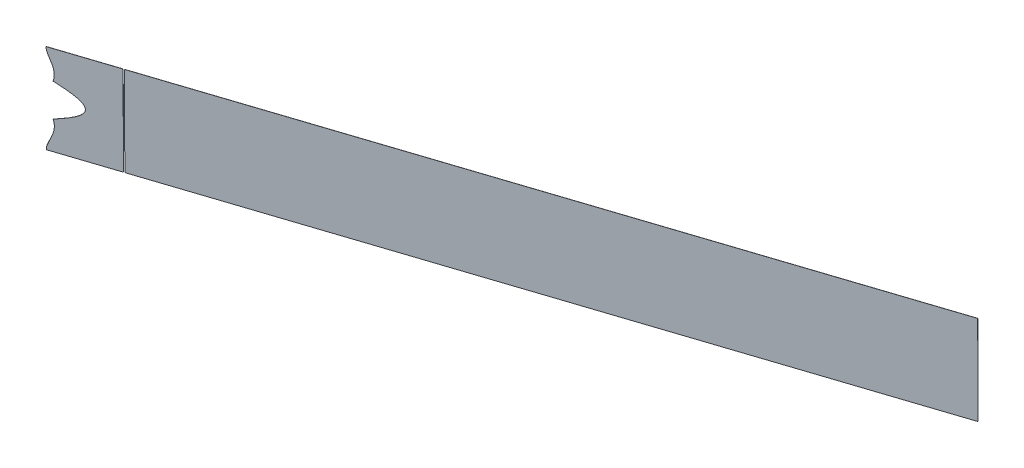
ISO-10303-21;
HEADER;
FILE_DESCRIPTION(('STEP AP214'),'2;1');
FILE_NAME('part.step','',(''),(''),'','','');
FILE_SCHEMA(('AUTOMOTIVE_DESIGN { 1 0 10303 214 1 1 1 1 }'));
ENDSEC;
DATA;
#1=APPLICATION_CONTEXT('core data for automotive mechanical design processes');
#2=APPLICATION_PROTOCOL_DEFINITION('international standard','automotive_design',2000,#1);
#3=PRODUCT_CONTEXT('',#1,'mechanical');
#4=PRODUCT('Part','Part','',(#3));
#5=PRODUCT_RELATED_PRODUCT_CATEGORY('part','',(#4));
#6=PRODUCT_DEFINITION_FORMATION('','',#4);
#7=PRODUCT_DEFINITION_CONTEXT('part definition',#1,'design');
#8=PRODUCT_DEFINITION('design','',#6,#7);
#9=PRODUCT_DEFINITION_SHAPE('','',#8);
#10=(LENGTH_UNIT() NAMED_UNIT(*) SI_UNIT(.MILLI.,.METRE.));
#11=(NAMED_UNIT(*) PLANE_ANGLE_UNIT() SI_UNIT($,.RADIAN.));
#12=(NAMED_UNIT(*) SI_UNIT($,.STERADIAN.) SOLID_ANGLE_UNIT());
#13=UNCERTAINTY_MEASURE_WITH_UNIT(LENGTH_MEASURE(1.E-05),#10,'distance_accuracy_value','');
#14=(GEOMETRIC_REPRESENTATION_CONTEXT(3) GLOBAL_UNCERTAINTY_ASSIGNED_CONTEXT((#13)) GLOBAL_UNIT_ASSIGNED_CONTEXT((#10,
#11,#12)) REPRESENTATION_CONTEXT('',''));
#15=CARTESIAN_POINT('',(0.,0.,0.));
#16=DIRECTION('',(0.,0.,1.));
#17=DIRECTION('',(1.,0.,0.));
#18=AXIS2_PLACEMENT_3D('',#15,#16,#17);
#19=CARTESIAN_POINT('',(6.44909519374498,0.0503968253967729,-15.4864176406941));
#20=DIRECTION('',(-0.00123855980853145,-0.999992126449225,-0.00377001447705828));
#21=DIRECTION('',(0.,0.00377001736872001,-0.999992893459268));
#22=AXIS2_PLACEMENT_3D('',#19,#20,#21);
#23=PLANE('',#22);
#24=DIRECTION('',(-0.312114614280563,0.00396825396825083,-0.950036168002534));
#25=VECTOR('',#24,1.);
#26=CARTESIAN_POINT('',(57.9082968346366,0.0503968253967729,-32.3922675570204));
#27=LINE('',#26,#25);
#28=CARTESIAN_POINT('',(57.9395082960627,0.0500000000007716,-32.2972639402194));
#29=VERTEX_POINT('',#28);
#30=CARTESIAN_POINT('',(57.9082968346366,0.0503968253973142,-32.3922675570202));
#31=VERTEX_POINT('',#30);
#32=EDGE_CURVE('E63',#29,#31,#27,.T.);
#33=ORIENTED_EDGE('',*,*,#32,.F.);
#34=DIRECTION('',(0.950043648219437,0.,-0.312117071750175));
#35=VECTOR('',#34,1.);
#36=CARTESIAN_POINT('',(6.48030665517302,0.0499999999999459,-15.3914140238938));
#37=LINE('',#36,#35);
#38=CARTESIAN_POINT('',(6.48030665517474,0.0499999999999459,-15.3914140238944));
#39=VERTEX_POINT('',#38);
#40=EDGE_CURVE('E111',#39,#29,#37,.T.);
#41=ORIENTED_EDGE('',*,*,#40,.F.);
#42=DIRECTION('',(0.312114614280564,-0.00396825396825083,0.950036168002534));
#43=VECTOR('',#42,1.);
#44=CARTESIAN_POINT('',(6.4490951937467,0.0503968253967729,-15.4864176406946));
#45=LINE('',#44,#43);
#46=CARTESIAN_POINT('',(6.4490951937467,0.0503968253967729,-15.4864176406946));
#47=VERTEX_POINT('',#46);
#48=EDGE_CURVE('E107',#47,#39,#45,.T.);
#49=ORIENTED_EDGE('',*,*,#48,.F.);
#50=DIRECTION('',(0.950043648219437,0.,-0.312117071750175));
#51=VECTOR('',#50,1.);
#52=CARTESIAN_POINT('',(6.44909519374498,0.0503968253967729,-15.4864176406941));
#53=LINE('',#52,#51);
#54=EDGE_CURVE('E109',#47,#31,#53,.T.);
#55=ORIENTED_EDGE('',*,*,#54,.T.);
#56=EDGE_LOOP('',(#33,#41,#49,#55));
#57=FACE_BOUND('',#56,.T.);
#58=ADVANCED_FACE('F53',(#57),#23,.T.);
#59=CARTESIAN_POINT('',(6871.92667565936,-6580.79861396681,-2298.48409723496));
#60=DIRECTION('',(-0.312114614280563,0.00396825396825084,-0.950036168002534));
#61=DIRECTION('',(-0.950043648219437,0.,0.312117071750175));
#62=AXIS2_PLACEMENT_3D('',#59,#60,#61);
#63=PLANE('',#62);
#64=DIRECTION('',(0.00123855980853475,0.999992126449225,0.00377001447705715));
#65=VECTOR('',#64,1.);
#66=CARTESIAN_POINT('',(58.0066160618442,79.4316688549329,-32.092996655937));
#67=LINE('',#66,#65);
#68=CARTESIAN_POINT('',(58.0066160618442,79.4316688549329,-32.092996655937));
#69=VERTEX_POINT('',#68);
#70=EDGE_CURVE('E14',#31,#69,#67,.T.);
#71=ORIENTED_EDGE('',*,*,#70,.F.);
#72=ORIENTED_EDGE('',*,*,#54,.F.);
#73=CARTESIAN_POINT('',(11.1777791862746,25.1320213635345,-16.935163668093));
#74=CARTESIAN_POINT('',(11.4013049539569,24.3216315351218,-17.0119833659873));
#75=CARTESIAN_POINT('',(11.7175626283366,22.7352598002908,-17.1225094401733));
#76=CARTESIAN_POINT('',(11.9015409457207,21.1308384263894,-17.1896532765855));
#77=CARTESIAN_POINT('',(11.9410736366971,19.5070411817098,-17.2094234401729));
#78=CARTESIAN_POINT('',(11.8311574871645,17.8855082268055,-17.1800858391739));
#79=CARTESIAN_POINT('',(11.5802054438747,16.2800321341019,-17.1043467612924));
#80=CARTESIAN_POINT('',(11.2038348608834,14.7005504226388,-16.9872954547073));
#81=CARTESIAN_POINT('',(10.7262006758602,13.1556474380202,-16.8368316651792));
#82=CARTESIAN_POINT('',(10.4313607311619,12.351647079097,-16.7433264061262));
#83=CARTESIAN_POINT('',(10.1736992903754,11.649028948144,-16.6616119023685));
#84=CARTESIAN_POINT('',(9.84465408982238,10.8417507728549,-16.5568829095368));
#85=CARTESIAN_POINT('',(9.58690060021095,10.2093793952467,-16.4748447478477));
#86=CARTESIAN_POINT('',(9.2150546625383,9.34361137147583,-16.3562987726462));
#87=CARTESIAN_POINT('',(9.10992445554976,9.09883695733999,-16.3227828413211));
#88=CARTESIAN_POINT('',(8.68145892472155,8.1077046837435,-16.186159317206));
#89=CARTESIAN_POINT('',(8.57404904963849,7.8574165178778,-16.151917479032));
#90=CARTESIAN_POINT('',(8.19903382971204,6.9835502044378,-16.0323641282483));
#91=CARTESIAN_POINT('',(7.9512704560516,6.36916846501407,-15.95353286945));
#92=CARTESIAN_POINT('',(7.61647565898677,5.53897388568841,-15.8470106870071));
#93=CARTESIAN_POINT('',(7.37560312028895,4.84633096187387,-15.7707701617358));
#94=CARTESIAN_POINT('',(7.09003761147453,4.02517081620186,-15.6803835011844));
#95=CARTESIAN_POINT('',(6.68292784167729,2.46307061900303,-15.553160872684));
#96=CARTESIAN_POINT('',(6.45359042827537,0.859564108087803,-15.484514604841));
#97=CARTESIAN_POINT('',(6.44909519374681,0.0503968253975917,-15.4864176406943));
#98=B_SPLINE_CURVE_WITH_KNOTS('',2,(#73,#74,#75,#76,#77,#78,#79,#80,#81,#82,#83,#84,#85,#86,#87,
#88,#89,#90,#91,#92,#93,#94,#95,#96,#97),.UNSPECIFIED.,.F.,.F.,(3,1,1,1,1,1,1,1,2,2,2,1,2,2,2,1,
1,3),(0.,0.0625,0.125,0.1875,0.25,0.3125,0.375,0.4375,0.5,0.5625,0.625,0.65625,0.6875,0.75,
0.8125,0.875,0.9375,1.),.UNSPECIFIED.);
#99=CARTESIAN_POINT('',(11.1777793190062,25.1320208823177,-16.9351637137093));
#100=VERTEX_POINT('',#99);
#101=EDGE_CURVE('E117',#100,#47,#98,.T.);
#102=ORIENTED_EDGE('',*,*,#101,.F.);
#103=CARTESIAN_POINT('',(11.1777791862746,25.1320213635345,-16.935163668093));
#104=CARTESIAN_POINT('',(12.8329681967551,25.7761520699014,-17.4762510736567));
#105=CARTESIAN_POINT('',(14.2420737805575,26.3470307532548,-17.9367988600515));
#106=CARTESIAN_POINT('',(15.8649211580312,27.0045038232543,-18.4672053646758));
#107=CARTESIAN_POINT('',(17.2856847164607,27.6147654809161,-18.93141863532));
#108=CARTESIAN_POINT('',(18.8968934119579,28.3068291839322,-19.4578570098047));
#109=CARTESIAN_POINT('',(20.3037617358497,28.9618698854944,-19.9173182504324));
#110=CARTESIAN_POINT('',(21.9128298785994,29.7110552265745,-20.4428147966029));
#111=CARTESIAN_POINT('',(23.2891394529787,30.4278062288062,-20.8919788350909));
#112=CARTESIAN_POINT('',(24.9029248526788,31.2682292877978,-21.4186440424505));
#113=CARTESIAN_POINT('',(26.2234316825662,32.0779448475189,-21.8490869420524));
#114=CARTESIAN_POINT('',(27.8113212780512,33.0516156256489,-22.3666880526712));
#115=CARTESIAN_POINT('',(28.9988351022366,33.9954428207608,-22.752878689968));
#116=CARTESIAN_POINT('',(30.5319011172791,35.2139123386953,-23.2514461418241));
#117=CARTESIAN_POINT('',(31.4223879251643,36.4026891665373,-23.5390315910969));
#118=CARTESIAN_POINT('',(31.9880220021756,37.1577960112773,-23.7217048533182));
#119=CARTESIAN_POINT('',(32.299230312167,37.9065450175713,-23.82081838035));
#120=CARTESIAN_POINT('',(32.6577777645336,38.7691892338407,-23.9350084629132));
#121=CARTESIAN_POINT('',(32.7039173012886,40.4975211384778,-23.9429474909546));
#122=CARTESIAN_POINT('',(32.3844029911622,41.3687585584673,-23.8343385974341));
#123=CARTESIAN_POINT('',(32.1033026134644,42.1352505748208,-23.7387873184384));
#124=CARTESIAN_POINT('',(31.555462981136,42.907900763358,-23.5555786853665));
#125=CARTESIAN_POINT('',(30.694342669723,44.1223889670293,-23.2676026685645));
#126=CARTESIAN_POINT('',(29.1621221371061,45.3667586611364,-22.7590258250923));
#127=CARTESIAN_POINT('',(27.9789219767959,46.327676747149,-22.3662963257044));
#128=CARTESIAN_POINT('',(26.3804697621052,47.3189257514631,-21.8370177138321));
#129=CARTESIAN_POINT('',(25.0703426474154,48.1313755613624,-21.4032091493553));
#130=CARTESIAN_POINT('',(23.4650854916182,48.974265998582,-20.8723146020609));
#131=CARTESIAN_POINT('',(22.085625476304,49.6985945905684,-20.4160962337476));
#132=CARTESIAN_POINT('',(20.4687868582983,50.4555765718469,-19.8817556733973));
#133=CARTESIAN_POINT('',(19.0459320825772,51.1217379408316,-19.4115238211332));
#134=CARTESIAN_POINT('',(17.4123122638222,51.8257223806463,-18.8718915145691));
#135=CARTESIAN_POINT('',(15.9706346950029,52.4469921302083,-18.3956633353734));
#136=CARTESIAN_POINT('',(14.3203235761943,53.1167500872248,-17.8506904118169));
#137=CARTESIAN_POINT('',(12.8934322108825,53.6958359546252,-17.3794961320907));
#138=CARTESIAN_POINT('',(11.2139677401216,54.3500443167953,-16.8250104312711));
#139=B_SPLINE_CURVE_WITH_KNOTS('',2,(#103,#104,#105,#106,#107,#108,#109,#110,#111,#112,#113,
#114,#115,#116,#117,#118,#119,#120,#121,#122,#123,#124,#125,#126,#127,#128,#129,#130,#131,#132,
#133,#134,#135,#136,#137,#138),.UNSPECIFIED.,.F.,.F.,(3,2,2,2,2,2,2,2,2,1,2,2,2,2,2,2,2,2,3),
(0.,0.0625,0.125,0.1875,0.25,0.3125,0.375,0.4375,0.46875,0.5,0.53125,0.5625,0.625,0.6875,0.75,
0.8125,0.875,0.9375,1.),.UNSPECIFIED.);
#140=CARTESIAN_POINT('',(11.2139681894776,54.3500441417559,-16.8250105796288));
#141=VERTEX_POINT('',#140);
#142=EDGE_CURVE('E123',#100,#141,#139,.T.);
#143=ORIENTED_EDGE('',*,*,#142,.T.);
#144=CARTESIAN_POINT('',(6.54741442095502,79.4316688549331,-15.1871467396114));
#145=CARTESIAN_POINT('',(6.54989092519148,78.627150442989,-15.1913207770623));
#146=CARTESIAN_POINT('',(6.77271347686487,77.0329846156009,-15.2711832414555));
#147=CARTESIAN_POINT('',(7.17340341607331,75.4731200835564,-15.4093370600805));
#148=CARTESIAN_POINT('',(7.45761587683613,74.6485651004181,-15.506153275343));
#149=CARTESIAN_POINT('',(7.69515157403772,73.9594283810983,-15.5870691758323));
#150=CARTESIAN_POINT('',(8.02497366884569,73.1352782731059,-15.6988677961542));
#151=CARTESIAN_POINT('',(8.27299650780827,72.5155258285802,-15.7829392141727));
#152=CARTESIAN_POINT('',(8.6487482575246,71.6346836052673,-15.9100638670477));
#153=CARTESIAN_POINT('',(8.75684878997329,71.3812729068073,-15.946636531509));
#154=CARTESIAN_POINT('',(9.18345876191184,70.3887427996384,-16.0909361097711));
#155=CARTESIAN_POINT('',(9.28665389418326,70.1471169396995,-16.125847982391));
#156=CARTESIAN_POINT('',(9.65527153867968,69.2840185223507,-16.2505547584479));
#157=CARTESIAN_POINT('',(9.9104662779802,68.6545654628266,-16.3370228740747));
#158=CARTESIAN_POINT('',(10.2398502211396,67.8421203029161,-16.4486286578021));
#159=CARTESIAN_POINT('',(10.7879069559757,66.3382052118522,-16.6349630726245));
#160=CARTESIAN_POINT('',(11.261939234603,64.7961786309693,-16.7971374824925));
#161=CARTESIAN_POINT('',(11.6348495316179,63.2188198851058,-16.9262379501881));
#162=CARTESIAN_POINT('',(11.8824519632439,61.6208658329154,-17.0142571517371));
#163=CARTESIAN_POINT('',(11.9908045371479,60.0001642896724,-17.0566237252385));
#164=CARTESIAN_POINT('',(11.9492173737807,58.3718586660987,-17.04976247993));
#165=CARTESIAN_POINT('',(11.7614698564702,56.7551472340225,-16.9948348633301));
#166=CARTESIAN_POINT('',(11.4391619242002,55.1592159297754,-16.8956134248168));
#167=CARTESIAN_POINT('',(11.2139677401216,54.3500443167953,-16.8250104312711));
#168=B_SPLINE_CURVE_WITH_KNOTS('',2,(#144,#145,#146,#147,#148,#149,#150,#151,#152,#153,#154,
#155,#156,#157,#158,#159,#160,#161,#162,#163,#164,#165,#166,#167),.UNSPECIFIED.,.F.,.F.,(3,1,1,
2,2,2,1,2,2,1,1,1,1,1,1,1,1,3),(0.,0.0625,0.125,0.1875,0.25,0.3125,0.34375,0.375,0.4375,0.5,
0.5625,0.625,0.6875,0.75,0.8125,0.875,0.9375,1.),.UNSPECIFIED.);
#169=CARTESIAN_POINT('',(6.54741442095502,79.4316688549331,-15.1871467396114));
#170=VERTEX_POINT('',#169);
#171=EDGE_CURVE('E139',#170,#141,#168,.T.);
#172=ORIENTED_EDGE('',*,*,#171,.F.);
#173=DIRECTION('',(0.950043648219437,0.,-0.312117071750175));
#174=VECTOR('',#173,1.);
#175=CARTESIAN_POINT('',(6.54741442095225,79.4316688549309,-15.1871467396108));
#176=LINE('',#175,#174);
#177=EDGE_CURVE('E234',#170,#69,#176,.T.);
#178=ORIENTED_EDGE('',*,*,#177,.T.);
#179=EDGE_LOOP('',(#71,#72,#102,#143,#172,#178));
#180=FACE_BOUND('',#179,.T.);
#181=ADVANCED_FACE('F121',(#180),#63,.T.);
#182=CARTESIAN_POINT('',(6871.95788712079,-6580.79901079221,-2298.38909361816));
#183=DIRECTION('',(-0.312114614280563,0.00396825396825084,-0.950036168002534));
#184=DIRECTION('',(-0.950043648219437,0.,0.312117071750175));
#185=AXIS2_PLACEMENT_3D('',#182,#183,#184);
#186=PLANE('',#185);
#187=ORIENTED_EDGE('',*,*,#40,.T.);
#188=DIRECTION('',(0.00123855980853477,0.999992126449225,0.0037700144770572));
#189=VECTOR('',#188,1.);
#190=CARTESIAN_POINT('',(49.788669029213,-6580.79901079218,-57.1073553257477));
#191=LINE('',#190,#189);
#192=CARTESIAN_POINT('',(58.037825918769,79.4312720284364,-31.9979925120153));
#193=VERTEX_POINT('',#192);
#194=EDGE_CURVE('E72',#29,#193,#191,.T.);
#195=ORIENTED_EDGE('',*,*,#194,.T.);
#196=DIRECTION('',(0.950043648219437,0.,-0.312117071750175));
#197=VECTOR('',#196,1.);
#198=CARTESIAN_POINT('',(6.57862588238029,79.431272029534,-15.0921431228105));
#199=LINE('',#198,#197);
#200=CARTESIAN_POINT('',(6.57862588238306,79.4312720295362,-15.0921431228112));
#201=VERTEX_POINT('',#200);
#202=EDGE_CURVE('E57',#201,#193,#199,.T.);
#203=ORIENTED_EDGE('',*,*,#202,.F.);
#204=CARTESIAN_POINT('',(6.57862588238306,79.4312720295362,-15.0921431228112));
#205=CARTESIAN_POINT('',(6.58110238661952,78.6267536175922,-15.0963171602621));
#206=CARTESIAN_POINT('',(6.80392493829296,77.032587790204,-15.1761796246552));
#207=CARTESIAN_POINT('',(7.20461487750135,75.4727232581596,-15.3143334432802));
#208=CARTESIAN_POINT('',(7.48882733826417,74.6481682750213,-15.4111496585428));
#209=CARTESIAN_POINT('',(7.72636303546581,73.9590315557015,-15.492065559032));
#210=CARTESIAN_POINT('',(8.05618513027379,73.1348814477091,-15.6038641793539));
#211=CARTESIAN_POINT('',(8.30420796923631,72.5151290031833,-15.6879355973724));
#212=CARTESIAN_POINT('',(8.67995971895269,71.6342867798705,-15.8150602502474));
#213=CARTESIAN_POINT('',(8.78806025140133,71.3808760814105,-15.8516329147088));
#214=CARTESIAN_POINT('',(9.21467022333988,70.3883459742416,-15.9959324929709));
#215=CARTESIAN_POINT('',(9.31786535561135,70.1467201143027,-16.0308443655908));
#216=CARTESIAN_POINT('',(9.68648300010772,69.2836216969539,-16.1555511416476));
#217=CARTESIAN_POINT('',(9.94167773940818,68.6541686374298,-16.2420192572745));
#218=CARTESIAN_POINT('',(10.2710616825676,67.8417234775193,-16.3536250410019));
#219=CARTESIAN_POINT('',(10.8191184174038,66.3378083864554,-16.5399594558243));
#220=CARTESIAN_POINT('',(11.293150696031,64.7957818055724,-16.7021338656923));
#221=CARTESIAN_POINT('',(11.6660609930459,63.218423059709,-16.8312343333878));
#222=CARTESIAN_POINT('',(11.913663424672,61.6204690075186,-16.9192535349368));
#223=CARTESIAN_POINT('',(12.022015998576,59.9997674642756,-16.9616201084383));
#224=CARTESIAN_POINT('',(11.9804288352088,58.3714618407018,-16.9547588631297));
#225=CARTESIAN_POINT('',(11.7926813178982,56.7547504086256,-16.8998312465299));
#226=CARTESIAN_POINT('',(11.4703733856282,55.1588191043786,-16.8006098080165));
#227=CARTESIAN_POINT('',(11.2451792015497,54.3496474913985,-16.7300068144709));
#228=B_SPLINE_CURVE_WITH_KNOTS('',2,(#204,#205,#206,#207,#208,#209,#210,#211,#212,#213,#214,
#215,#216,#217,#218,#219,#220,#221,#222,#223,#224,#225,#226,#227),.UNSPECIFIED.,.F.,.F.,(3,1,1,
2,2,2,1,2,2,1,1,1,1,1,1,1,1,3),(0.,0.0625,0.125,0.1875,0.25,0.3125,0.34375,0.375,0.4375,0.5,
0.5625,0.625,0.6875,0.75,0.8125,0.875,0.9375,1.),.UNSPECIFIED.);
#229=CARTESIAN_POINT('',(11.2451796509056,54.3496473163591,-16.7300069628285));
#230=VERTEX_POINT('',#229);
#231=EDGE_CURVE('E224',#201,#230,#228,.T.);
#232=ORIENTED_EDGE('',*,*,#231,.T.);
#233=CARTESIAN_POINT('',(11.2089906477026,25.1316245381377,-16.8401600512928));
#234=CARTESIAN_POINT('',(12.864179658183,25.7757552445046,-17.3812474568565));
#235=CARTESIAN_POINT('',(14.2732852419856,26.346633927858,-17.8417952432512));
#236=CARTESIAN_POINT('',(15.8961326194593,27.0041069978575,-18.3722017478756));
#237=CARTESIAN_POINT('',(17.3168961778888,27.6143686555192,-18.8364150185198));
#238=CARTESIAN_POINT('',(18.928104873386,28.3064323585354,-19.3628533930045));
#239=CARTESIAN_POINT('',(20.3349731972778,28.9614730600975,-19.8223146336322));
#240=CARTESIAN_POINT('',(21.9440413400275,29.7106584011777,-20.3478111798027));
#241=CARTESIAN_POINT('',(23.3203509144067,30.4274094034094,-20.7969752182906));
#242=CARTESIAN_POINT('',(24.9341363141068,31.2678324624009,-21.3236404256503));
#243=CARTESIAN_POINT('',(26.2546431439942,32.077548022122,-21.7540833252522));
#244=CARTESIAN_POINT('',(27.8425327394792,33.0512188002521,-22.271684435871));
#245=CARTESIAN_POINT('',(29.0300465636646,33.995045995364,-22.6578750731678));
#246=CARTESIAN_POINT('',(30.563112578707,35.2135155132984,-23.1564425250238));
#247=CARTESIAN_POINT('',(31.4535993865924,36.4022923411404,-23.4440279742966));
#248=CARTESIAN_POINT('',(32.0192334636036,37.1573991858805,-23.6267012365179));
#249=CARTESIAN_POINT('',(32.3304417735952,37.9061481921745,-23.7258147635497));
#250=CARTESIAN_POINT('',(32.6889892259617,38.7687924084439,-23.8400048461129));
#251=CARTESIAN_POINT('',(32.7351287627167,40.4971243130809,-23.8479438741543));
#252=CARTESIAN_POINT('',(32.4156144525902,41.3683617330705,-23.7393349806339));
#253=CARTESIAN_POINT('',(32.1345140748925,42.1348537494239,-23.6437837016382));
#254=CARTESIAN_POINT('',(31.586674442564,42.9075039379612,-23.4605750685662));
#255=CARTESIAN_POINT('',(30.7255541311511,44.1219921416325,-23.1725990517643));
#256=CARTESIAN_POINT('',(29.1933335985342,45.3663618357396,-22.664022208292));
#257=CARTESIAN_POINT('',(28.0101334382239,46.3272799217522,-22.2712927089041));
#258=CARTESIAN_POINT('',(26.4116812235333,47.3185289260662,-21.7420140970319));
#259=CARTESIAN_POINT('',(25.1015541088435,48.1309787359656,-21.308205532555));
#260=CARTESIAN_POINT('',(23.4962969530462,48.9738691731851,-20.7773109852606));
#261=CARTESIAN_POINT('',(22.1168369377321,49.6981977651716,-20.3210926169474));
#262=CARTESIAN_POINT('',(20.4999983197264,50.4551797464501,-19.7867520565971));
#263=CARTESIAN_POINT('',(19.0771435440051,51.1213411154348,-19.3165202043329));
#264=CARTESIAN_POINT('',(17.4435237252503,51.8253255552494,-18.7768878977688));
#265=CARTESIAN_POINT('',(16.001846156431,52.4465953048114,-18.3006597185731));
#266=CARTESIAN_POINT('',(14.3515350376224,53.1163532618279,-17.7556867950167));
#267=CARTESIAN_POINT('',(12.9246436723106,53.6954391292284,-17.2844925152905));
#268=CARTESIAN_POINT('',(11.2451792015497,54.3496474913985,-16.7300068144709));
#269=B_SPLINE_CURVE_WITH_KNOTS('',2,(#233,#234,#235,#236,#237,#238,#239,#240,#241,#242,#243,
#244,#245,#246,#247,#248,#249,#250,#251,#252,#253,#254,#255,#256,#257,#258,#259,#260,#261,#262,
#263,#264,#265,#266,#267,#268),.UNSPECIFIED.,.F.,.F.,(3,2,2,2,2,2,2,2,2,1,2,2,2,2,2,2,2,2,3),
(0.,0.0625,0.125,0.1875,0.25,0.3125,0.375,0.4375,0.46875,0.5,0.53125,0.5625,0.625,0.6875,0.75,
0.8125,0.875,0.9375,1.),.UNSPECIFIED.);
#270=CARTESIAN_POINT('',(11.2089907804342,25.1316240569209,-16.840160096909));
#271=VERTEX_POINT('',#270);
#272=EDGE_CURVE('E116',#271,#230,#269,.T.);
#273=ORIENTED_EDGE('',*,*,#272,.F.);
#274=CARTESIAN_POINT('',(11.2089906477026,25.1316245381377,-16.8401600512928));
#275=CARTESIAN_POINT('',(11.432516415385,24.321234709725,-16.9169797491871));
#276=CARTESIAN_POINT('',(11.7487740897646,22.734862974894,-17.0275058233731));
#277=CARTESIAN_POINT('',(11.9327524071489,21.1304416009925,-17.0946496597852));
#278=CARTESIAN_POINT('',(11.9722850981251,19.506644356313,-17.1144198233726));
#279=CARTESIAN_POINT('',(11.8623689485926,17.8851114014087,-17.0850822223736));
#280=CARTESIAN_POINT('',(11.6114169053028,16.2796353087051,-17.0093431444921));
#281=CARTESIAN_POINT('',(11.2350463223115,14.700153597242,-16.8922918379071));
#282=CARTESIAN_POINT('',(10.7574121372882,13.1552506126233,-16.741828048379));
#283=CARTESIAN_POINT('',(10.46257219259,12.3512502537002,-16.648322789326));
#284=CARTESIAN_POINT('',(10.2049107518035,11.6486321227471,-16.5666082855683));
#285=CARTESIAN_POINT('',(9.87586555125053,10.8413539474581,-16.4618792927366));
#286=CARTESIAN_POINT('',(9.61811206163893,10.2089825698499,-16.3798411310474));
#287=CARTESIAN_POINT('',(9.24626612396634,9.343214546079,-16.2612951558459));
#288=CARTESIAN_POINT('',(9.14113591697779,9.09844013194316,-16.2277792245209));
#289=CARTESIAN_POINT('',(8.71267038614959,8.10730785834668,-16.0911557004057));
#290=CARTESIAN_POINT('',(8.60526051106642,7.85701969248097,-16.0569138622317));
#291=CARTESIAN_POINT('',(8.23024529114008,6.98315337904098,-15.9373605114481));
#292=CARTESIAN_POINT('',(7.98248191747969,6.36877163961724,-15.8585292526498));
#293=CARTESIAN_POINT('',(7.64768712041486,5.53857706029159,-15.7520070702069));
#294=CARTESIAN_POINT('',(7.40681458171699,4.84593413647705,-15.6757665449356));
#295=CARTESIAN_POINT('',(7.12124907290262,4.02477399080503,-15.5853798843841));
#296=CARTESIAN_POINT('',(6.71413930310533,2.4626737936062,-15.4581572558837));
#297=CARTESIAN_POINT('',(6.48480188970341,0.859167282690969,-15.3895109880408));
#298=CARTESIAN_POINT('',(6.48030665517485,0.0500000000007716,-15.391414023894));
#299=B_SPLINE_CURVE_WITH_KNOTS('',2,(#274,#275,#276,#277,#278,#279,#280,#281,#282,#283,#284,
#285,#286,#287,#288,#289,#290,#291,#292,#293,#294,#295,#296,#297,#298),.UNSPECIFIED.,.F.,.F.,(3,
1,1,1,1,1,1,1,2,2,2,1,2,2,2,1,1,3),(0.,0.0625,0.125,0.1875,0.25,0.3125,0.375,0.4375,0.5,0.5625,
0.625,0.65625,0.6875,0.75,0.8125,0.875,0.9375,1.),.UNSPECIFIED.);
#300=EDGE_CURVE('E213',#271,#39,#299,.T.);
#301=ORIENTED_EDGE('',*,*,#300,.T.);
#302=EDGE_LOOP('',(#187,#195,#203,#232,#273,#301));
#303=FACE_BOUND('',#302,.T.);
#304=ADVANCED_FACE('F158',(#303),#186,.F.);
#305=DIRECTION('',(0.312114614280564,-0.00396825396825083,0.950036168002534));
#306=VECTOR('',#305,1.);
#307=SURFACE_OF_LINEAR_EXTRUSION('',#168,#306);
#308=ORIENTED_EDGE('',*,*,#231,.F.);
#309=DIRECTION('',(0.312114614280564,-0.00396825396825083,0.950036168002534));
#310=VECTOR('',#309,1.);
#311=CARTESIAN_POINT('',(6.54741442095502,79.4316688549331,-15.1871467396114));
#312=LINE('',#311,#310);
#313=EDGE_CURVE('E126',#170,#201,#312,.T.);
#314=ORIENTED_EDGE('',*,*,#313,.F.);
#315=ORIENTED_EDGE('',*,*,#171,.T.);
#316=DIRECTION('',(0.312114614280564,-0.00396825396825083,0.950036168002534));
#317=VECTOR('',#316,1.);
#318=CARTESIAN_POINT('',(11.2139681894776,54.3500441417559,-16.8250105796288));
#319=LINE('',#318,#317);
#320=EDGE_CURVE('E207',#141,#230,#319,.T.);
#321=ORIENTED_EDGE('',*,*,#320,.T.);
#322=EDGE_LOOP('',(#308,#314,#315,#321));
#323=FACE_BOUND('',#322,.T.);
#324=ADVANCED_FACE('F152',(#323),#307,.T.);
#325=CARTESIAN_POINT('',(6.54741442095225,79.4316688549309,-15.1871467396108));
#326=DIRECTION('',(-0.00123855980853144,-0.999992126449225,-0.00377001447705828));
#327=DIRECTION('',(0.,0.00377001736872002,-0.999992893459268));
#328=AXIS2_PLACEMENT_3D('',#325,#326,#327);
#329=PLANE('',#328);
#330=ORIENTED_EDGE('',*,*,#202,.T.);
#331=DIRECTION('',(-0.312114614280563,0.00396825396825081,-0.950036168002534));
#332=VECTOR('',#331,1.);
#333=CARTESIAN_POINT('',(61.1277622046498,79.3919863152504,-22.5926349759117));
#334=LINE('',#333,#332);
#335=EDGE_CURVE('E128',#193,#69,#334,.T.);
#336=ORIENTED_EDGE('',*,*,#335,.T.);
#337=ORIENTED_EDGE('',*,*,#177,.F.);
#338=ORIENTED_EDGE('',*,*,#313,.T.);
#339=EDGE_LOOP('',(#330,#336,#337,#338));
#340=FACE_BOUND('',#339,.T.);
#341=ADVANCED_FACE('F55',(#340),#329,.F.);
#342=DIRECTION('',(0.312114614280564,-0.00396825396825083,0.950036168002534));
#343=VECTOR('',#342,1.);
#344=SURFACE_OF_LINEAR_EXTRUSION('',#98,#343);
#345=ORIENTED_EDGE('',*,*,#300,.F.);
#346=DIRECTION('',(0.312114614280564,-0.00396825396825083,0.950036168002534));
#347=VECTOR('',#346,1.);
#348=CARTESIAN_POINT('',(11.1777793190062,25.1320208823177,-16.9351637137093));
#349=LINE('',#348,#347);
#350=EDGE_CURVE('E88',#100,#271,#349,.T.);
#351=ORIENTED_EDGE('',*,*,#350,.F.);
#352=ORIENTED_EDGE('',*,*,#101,.T.);
#353=ORIENTED_EDGE('',*,*,#48,.T.);
#354=EDGE_LOOP('',(#345,#351,#352,#353));
#355=FACE_BOUND('',#354,.T.);
#356=ADVANCED_FACE('F125',(#355),#344,.T.);
#357=DIRECTION('',(0.312114614280564,-0.00396825396825083,0.950036168002534));
#358=VECTOR('',#357,1.);
#359=SURFACE_OF_LINEAR_EXTRUSION('',#139,#358);
#360=ORIENTED_EDGE('',*,*,#272,.T.);
#361=ORIENTED_EDGE('',*,*,#320,.F.);
#362=ORIENTED_EDGE('',*,*,#142,.F.);
#363=ORIENTED_EDGE('',*,*,#350,.T.);
#364=EDGE_LOOP('',(#360,#361,#362,#363));
#365=FACE_BOUND('',#364,.T.);
#366=ADVANCED_FACE('F151',(#365),#359,.F.);
#367=CARTESIAN_POINT('',(61.1277622046498,79.3919863152504,-22.5926349759117));
#368=DIRECTION('',(-0.950043648219437,0.,0.312117071750175));
#369=DIRECTION('',(0.312117071750175,0.,0.950043648219437));
#370=AXIS2_PLACEMENT_3D('',#367,#368,#369);
#371=PLANE('',#370);
#372=ORIENTED_EDGE('',*,*,#32,.T.);
#373=ORIENTED_EDGE('',*,*,#70,.T.);
#374=ORIENTED_EDGE('',*,*,#335,.F.);
#375=ORIENTED_EDGE('',*,*,#194,.F.);
#376=EDGE_LOOP('',(#372,#373,#374,#375));
#377=FACE_BOUND('',#376,.T.);
#378=ADVANCED_FACE('F155',(#377),#371,.F.);
#379=CLOSED_SHELL('',(#58,#181,#304,#324,#341,#356,#366,#378));
#380=MANIFOLD_SOLID_BREP('B2',#379);
#381=CARTESIAN_POINT('',(627.934485766299,0.0503968253967868,-219.662510607126));
#382=DIRECTION('',(0.950043648219437,0.,-0.312117071750176));
#383=DIRECTION('',(-0.312117071750176,0.,-0.950043648219436));
#384=AXIS2_PLACEMENT_3D('',#381,#382,#383);
#385=PLANE('',#384);
#386=DIRECTION('',(0.0012385598085337,0.999992126449225,0.00377001447705725));
#387=VECTOR('',#386,1.);
#388=CARTESIAN_POINT('',(627.965697227727,0.0499999999999598,-219.567506990325));
#389=LINE('',#388,#387);
#390=CARTESIAN_POINT('',(627.965697227727,0.0499999999999598,-219.567506990325));
#391=VERTEX_POINT('',#390);
#392=CARTESIAN_POINT('',(628.064016454934,79.431272029534,-219.268236089242));
#393=VERTEX_POINT('',#392);
#394=EDGE_CURVE('E285',#391,#393,#389,.T.);
#395=ORIENTED_EDGE('',*,*,#394,.F.);
#396=DIRECTION('',(0.312114614280564,-0.00396825396825083,0.950036168002534));
#397=VECTOR('',#396,1.);
#398=CARTESIAN_POINT('',(627.934485766299,0.0503968253967868,-219.662510607126));
#399=LINE('',#398,#397);
#400=CARTESIAN_POINT('',(627.934485766299,0.0503968253967868,-219.662510607126));
#401=VERTEX_POINT('',#400);
#402=EDGE_CURVE('E288',#401,#391,#399,.T.);
#403=ORIENTED_EDGE('',*,*,#402,.F.);
#404=DIRECTION('',(0.0012385598085337,0.999992126449225,0.00377001447705725));
#405=VECTOR('',#404,1.);
#406=CARTESIAN_POINT('',(627.934485766299,0.0503968253967868,-219.662510607126));
#407=LINE('',#406,#405);
#408=CARTESIAN_POINT('',(628.032804993506,79.4316688549309,-219.363239706042));
#409=VERTEX_POINT('',#408);
#410=EDGE_CURVE('E302',#401,#409,#407,.T.);
#411=ORIENTED_EDGE('',*,*,#410,.T.);
#412=DIRECTION('',(0.312114614280564,-0.00396825396825083,0.950036168002534));
#413=VECTOR('',#412,1.);
#414=CARTESIAN_POINT('',(628.032804993506,79.4316688549309,-219.363239706042));
#415=LINE('',#414,#413);
#416=EDGE_CURVE('E253',#409,#393,#415,.T.);
#417=ORIENTED_EDGE('',*,*,#416,.T.);
#418=EDGE_LOOP('',(#395,#403,#411,#417));
#419=FACE_BOUND('',#418,.T.);
#420=ADVANCED_FACE('F245',(#419),#385,.T.);
#421=CARTESIAN_POINT('',(6871.95788712079,-6580.79901079221,-2298.38909361816));
#422=DIRECTION('',(-0.312114614280563,0.00396825396825084,-0.950036168002534));
#423=DIRECTION('',(-0.950043648219437,0.,0.312117071750175));
#424=AXIS2_PLACEMENT_3D('',#421,#422,#423);
#425=PLANE('',#424);
#426=DIRECTION('',(0.950043648219437,0.,-0.312117071750175));
#427=VECTOR('',#426,1.);
#428=CARTESIAN_POINT('',(6.57862588238029,79.431272029534,-15.0921431228105));
#429=LINE('',#428,#427);
#430=CARTESIAN_POINT('',(58.9878711714911,79.4312720295354,-32.3101101108867));
#431=VERTEX_POINT('',#430);
#432=EDGE_CURVE('E296',#431,#393,#429,.T.);
#433=ORIENTED_EDGE('',*,*,#432,.F.);
#434=DIRECTION('',(-0.00123855980853493,-0.999992126449225,-0.00377001447705715));
#435=VECTOR('',#434,1.);
#436=CARTESIAN_POINT('',(50.7387126774326,-6580.79901079218,-57.4194723974979));
#437=LINE('',#436,#435);
#438=CARTESIAN_POINT('',(58.8895519442835,0.0499999999999112,-32.60938101197));
#439=VERTEX_POINT('',#438);
#440=EDGE_CURVE('E51',#431,#439,#437,.T.);
#441=ORIENTED_EDGE('',*,*,#440,.T.);
#442=DIRECTION('',(0.950043648219437,0.,-0.312117071750175));
#443=VECTOR('',#442,1.);
#444=CARTESIAN_POINT('',(6.48030665517302,0.0499999999999459,-15.3914140238938));
#445=LINE('',#444,#443);
#446=EDGE_CURVE('E281',#439,#391,#445,.T.);
#447=ORIENTED_EDGE('',*,*,#446,.T.);
#448=ORIENTED_EDGE('',*,*,#394,.T.);
#449=EDGE_LOOP('',(#433,#441,#447,#448));
#450=FACE_BOUND('',#449,.T.);
#451=ADVANCED_FACE('F283',(#450),#425,.F.);
#452=CARTESIAN_POINT('',(6871.92667565936,-6580.79861396681,-2298.48409723496));
#453=DIRECTION('',(-0.312114614280563,0.00396825396825084,-0.950036168002534));
#454=DIRECTION('',(-0.950043648219437,0.,0.312117071750175));
#455=AXIS2_PLACEMENT_3D('',#452,#453,#454);
#456=PLANE('',#455);
#457=DIRECTION('',(-0.00123855980853493,-0.999992126449225,-0.00377001447705715));
#458=VECTOR('',#457,1.);
#459=CARTESIAN_POINT('',(58.9566613208198,79.4329693521122,-32.4051088247554));
#460=LINE('',#459,#458);
#461=CARTESIAN_POINT('',(58.9566597100636,79.4316688549328,-32.4051137276872));
#462=VERTEX_POINT('',#461);
#463=CARTESIAN_POINT('',(58.858340482856,0.0503968253967729,-32.7043846287704));
#464=VERTEX_POINT('',#463);
#465=EDGE_CURVE('E308',#462,#464,#460,.T.);
#466=ORIENTED_EDGE('',*,*,#465,.F.);
#467=DIRECTION('',(0.950043648219437,0.,-0.312117071750175));
#468=VECTOR('',#467,1.);
#469=CARTESIAN_POINT('',(6.54741442095225,79.4316688549309,-15.1871467396108));
#470=LINE('',#469,#468);
#471=EDGE_CURVE('E286',#462,#409,#470,.T.);
#472=ORIENTED_EDGE('',*,*,#471,.T.);
#473=ORIENTED_EDGE('',*,*,#410,.F.);
#474=DIRECTION('',(0.950043648219437,0.,-0.312117071750175));
#475=VECTOR('',#474,1.);
#476=CARTESIAN_POINT('',(6.44909519374498,0.0503968253967729,-15.4864176406941));
#477=LINE('',#476,#475);
#478=EDGE_CURVE('E267',#464,#401,#477,.T.);
#479=ORIENTED_EDGE('',*,*,#478,.F.);
#480=EDGE_LOOP('',(#466,#472,#473,#479));
#481=FACE_BOUND('',#480,.T.);
#482=ADVANCED_FACE('F317',(#481),#456,.T.);
#483=CARTESIAN_POINT('',(6.44909519374498,0.0503968253967729,-15.4864176406941));
#484=DIRECTION('',(-0.00123855980853145,-0.999992126449225,-0.00377001447705828));
#485=DIRECTION('',(0.,0.00377001736872001,-0.999992893459268));
#486=AXIS2_PLACEMENT_3D('',#483,#484,#485);
#487=PLANE('',#486);
#488=DIRECTION('',(-0.312114614280563,0.00396825396825081,-0.950036168002534));
#489=VECTOR('',#488,1.);
#490=CARTESIAN_POINT('',(61.9794866256617,0.0107142857142667,-23.204022948745));
#491=LINE('',#490,#489);
#492=EDGE_CURVE('E260',#439,#464,#491,.T.);
#493=ORIENTED_EDGE('',*,*,#492,.T.);
#494=ORIENTED_EDGE('',*,*,#478,.T.);
#495=ORIENTED_EDGE('',*,*,#402,.T.);
#496=ORIENTED_EDGE('',*,*,#446,.F.);
#497=EDGE_LOOP('',(#493,#494,#495,#496));
#498=FACE_BOUND('',#497,.T.);
#499=ADVANCED_FACE('F289',(#498),#487,.T.);
#500=CARTESIAN_POINT('',(6.54741442095225,79.4316688549309,-15.1871467396108));
#501=DIRECTION('',(-0.00123855980853144,-0.999992126449225,-0.00377001447705828));
#502=DIRECTION('',(0.,0.00377001736872002,-0.999992893459268));
#503=AXIS2_PLACEMENT_3D('',#500,#501,#502);
#504=PLANE('',#503);
#505=ORIENTED_EDGE('',*,*,#471,.F.);
#506=DIRECTION('',(0.312114614280563,-0.00396825396825083,0.950036168002534));
#507=VECTOR('',#506,1.);
#508=CARTESIAN_POINT('',(58.9566597100636,79.4316688549309,-32.4051137276874));
#509=LINE('',#508,#507);
#510=EDGE_CURVE('E298',#462,#431,#509,.T.);
#511=ORIENTED_EDGE('',*,*,#510,.T.);
#512=ORIENTED_EDGE('',*,*,#432,.T.);
#513=ORIENTED_EDGE('',*,*,#416,.F.);
#514=EDGE_LOOP('',(#505,#511,#512,#513));
#515=FACE_BOUND('',#514,.T.);
#516=ADVANCED_FACE('F247',(#515),#504,.F.);
#517=CARTESIAN_POINT('',(62.0778074636255,79.3932868124297,-22.9047471447301));
#518=DIRECTION('',(0.950043648219437,0.,-0.312117071750175));
#519=DIRECTION('',(-0.312117071750175,0.,-0.950043648219437));
#520=AXIS2_PLACEMENT_3D('',#517,#518,#519);
#521=PLANE('',#520);
#522=ORIENTED_EDGE('',*,*,#465,.T.);
#523=ORIENTED_EDGE('',*,*,#492,.F.);
#524=ORIENTED_EDGE('',*,*,#440,.F.);
#525=ORIENTED_EDGE('',*,*,#510,.F.);
#526=EDGE_LOOP('',(#522,#523,#524,#525));
#527=FACE_BOUND('',#526,.T.);
#528=ADVANCED_FACE('F312',(#527),#521,.F.);
#529=CLOSED_SHELL('',(#420,#451,#482,#499,#516,#528));
#530=MANIFOLD_SOLID_BREP('B8',#529);
#531=ADVANCED_BREP_SHAPE_REPRESENTATION('',(#18,#380,#530),#14);
#532=SHAPE_DEFINITION_REPRESENTATION(#9,#531);
ENDSEC;
END-ISO-10303-21;
